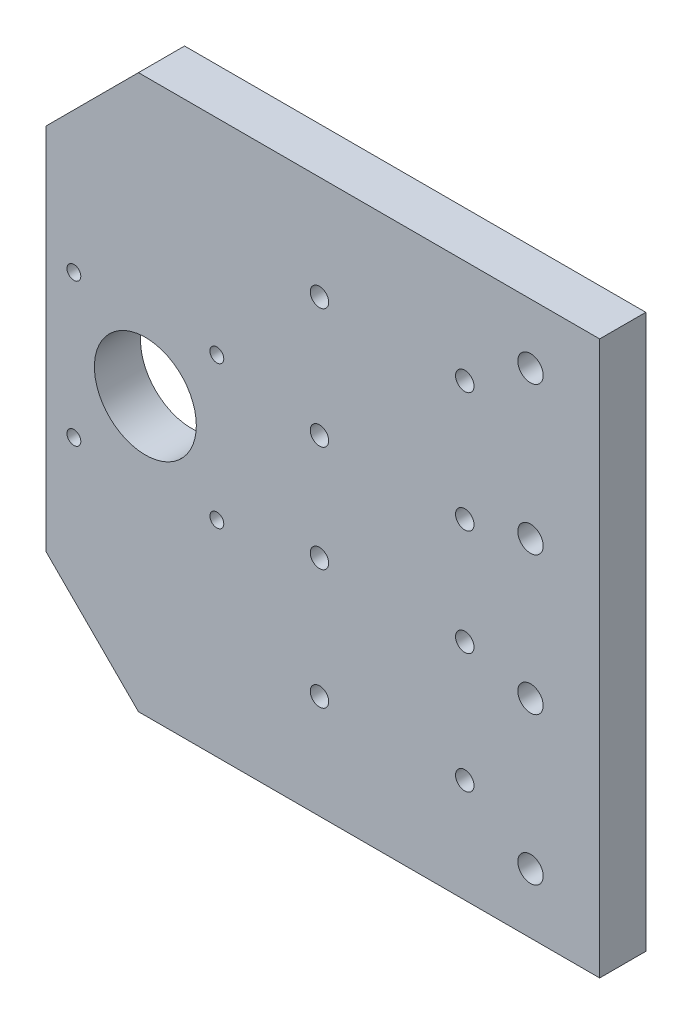
ISO-10303-21;
HEADER;
FILE_DESCRIPTION(('STEP AP214'),'2;1');
FILE_NAME('part.step','',(''),(''),'','','');
FILE_SCHEMA(('AUTOMOTIVE_DESIGN { 1 0 10303 214 1 1 1 1 }'));
ENDSEC;
DATA;
#1=APPLICATION_CONTEXT('core data for automotive mechanical design processes');
#2=APPLICATION_PROTOCOL_DEFINITION('international standard','automotive_design',2000,#1);
#3=PRODUCT_CONTEXT('',#1,'mechanical');
#4=PRODUCT('Part','Part','',(#3));
#5=PRODUCT_RELATED_PRODUCT_CATEGORY('part','',(#4));
#6=PRODUCT_DEFINITION_FORMATION('','',#4);
#7=PRODUCT_DEFINITION_CONTEXT('part definition',#1,'design');
#8=PRODUCT_DEFINITION('design','',#6,#7);
#9=PRODUCT_DEFINITION_SHAPE('','',#8);
#10=(LENGTH_UNIT() NAMED_UNIT(*) SI_UNIT(.MILLI.,.METRE.));
#11=(NAMED_UNIT(*) PLANE_ANGLE_UNIT() SI_UNIT($,.RADIAN.));
#12=(NAMED_UNIT(*) SI_UNIT($,.STERADIAN.) SOLID_ANGLE_UNIT());
#13=UNCERTAINTY_MEASURE_WITH_UNIT(LENGTH_MEASURE(1.E-05),#10,'distance_accuracy_value','');
#14=(GEOMETRIC_REPRESENTATION_CONTEXT(3) GLOBAL_UNCERTAINTY_ASSIGNED_CONTEXT((#13)) GLOBAL_UNIT_ASSIGNED_CONTEXT((#10,
#11,#12)) REPRESENTATION_CONTEXT('',''));
#15=CARTESIAN_POINT('',(0.,0.,0.));
#16=DIRECTION('',(0.,0.,1.));
#17=DIRECTION('',(1.,0.,0.));
#18=AXIS2_PLACEMENT_3D('',#15,#16,#17);
#19=CARTESIAN_POINT('',(0.,0.,10.));
#20=DIRECTION('',(0.,0.,1.));
#21=DIRECTION('',(1.,0.,0.));
#22=AXIS2_PLACEMENT_3D('',#19,#20,#21);
#23=PLANE('',#22);
#24=CARTESIAN_POINT('',(-15.,-15.,10.));
#25=DIRECTION('',(0.,0.,1.));
#26=DIRECTION('',(1.,0.,0.));
#27=AXIS2_PLACEMENT_3D('',#24,#25,#26);
#28=CIRCLE('',#27,2.75000000000001);
#29=CARTESIAN_POINT('',(-12.25,-15.,10.));
#30=VERTEX_POINT('',#29);
#31=EDGE_CURVE('E241',#30,#30,#28,.T.);
#32=ORIENTED_EDGE('',*,*,#31,.F.);
#33=EDGE_LOOP('',(#32));
#34=FACE_BOUND('',#33,.T.);
#35=CARTESIAN_POINT('',(-15.,47.,10.));
#36=DIRECTION('',(0.,0.,1.));
#37=DIRECTION('',(1.,0.,0.));
#38=AXIS2_PLACEMENT_3D('',#35,#36,#37);
#39=CIRCLE('',#38,2.75000000000001);
#40=CARTESIAN_POINT('',(-12.25,47.,10.));
#41=VERTEX_POINT('',#40);
#42=EDGE_CURVE('E253',#41,#41,#39,.T.);
#43=ORIENTED_EDGE('',*,*,#42,.F.);
#44=EDGE_LOOP('',(#43));
#45=FACE_BOUND('',#44,.T.);
#46=CARTESIAN_POINT('',(-29.25,-37.5,10.));
#47=DIRECTION('',(0.,0.,1.));
#48=DIRECTION('',(1.,0.,0.));
#49=AXIS2_PLACEMENT_3D('',#46,#47,#48);
#50=CIRCLE('',#49,2.);
#51=CARTESIAN_POINT('',(-27.25,-37.5,10.));
#52=VERTEX_POINT('',#51);
#53=EDGE_CURVE('E265',#52,#52,#50,.T.);
#54=ORIENTED_EDGE('',*,*,#53,.F.);
#55=EDGE_LOOP('',(#54));
#56=FACE_BOUND('',#55,.T.);
#57=CARTESIAN_POINT('',(-60.75,-11.5,10.));
#58=DIRECTION('',(0.,0.,1.));
#59=DIRECTION('',(1.,0.,0.));
#60=AXIS2_PLACEMENT_3D('',#57,#58,#59);
#61=CIRCLE('',#60,2.);
#62=CARTESIAN_POINT('',(-58.75,-11.5,10.));
#63=VERTEX_POINT('',#62);
#64=EDGE_CURVE('E277',#63,#63,#61,.T.);
#65=ORIENTED_EDGE('',*,*,#64,.F.);
#66=EDGE_LOOP('',(#65));
#67=FACE_BOUND('',#66,.T.);
#68=CARTESIAN_POINT('',(-60.75,11.5,10.));
#69=DIRECTION('',(0.,0.,1.));
#70=DIRECTION('',(1.,0.,0.));
#71=AXIS2_PLACEMENT_3D('',#68,#69,#70);
#72=CIRCLE('',#71,2.);
#73=CARTESIAN_POINT('',(-58.75,11.5,10.));
#74=VERTEX_POINT('',#73);
#75=EDGE_CURVE('E289',#74,#74,#72,.T.);
#76=ORIENTED_EDGE('',*,*,#75,.F.);
#77=EDGE_LOOP('',(#76));
#78=FACE_BOUND('',#77,.T.);
#79=CARTESIAN_POINT('',(-60.75,37.5,10.));
#80=DIRECTION('',(0.,0.,1.));
#81=DIRECTION('',(1.,0.,0.));
#82=AXIS2_PLACEMENT_3D('',#79,#80,#81);
#83=CIRCLE('',#82,2.);
#84=CARTESIAN_POINT('',(-58.75,37.5,10.));
#85=VERTEX_POINT('',#84);
#86=EDGE_CURVE('E301',#85,#85,#83,.T.);
#87=ORIENTED_EDGE('',*,*,#86,.F.);
#88=EDGE_LOOP('',(#87));
#89=FACE_BOUND('',#88,.T.);
#90=CARTESIAN_POINT('',(-114.,-15.5,10.));
#91=DIRECTION('',(0.,0.,1.));
#92=DIRECTION('',(1.,0.,0.));
#93=AXIS2_PLACEMENT_3D('',#90,#91,#92);
#94=CIRCLE('',#93,1.5);
#95=CARTESIAN_POINT('',(-112.5,-15.5,10.));
#96=VERTEX_POINT('',#95);
#97=EDGE_CURVE('E313',#96,#96,#94,.T.);
#98=ORIENTED_EDGE('',*,*,#97,.F.);
#99=EDGE_LOOP('',(#98));
#100=FACE_BOUND('',#99,.T.);
#101=CARTESIAN_POINT('',(-83.,15.5,10.));
#102=DIRECTION('',(0.,0.,1.));
#103=DIRECTION('',(1.,0.,0.));
#104=AXIS2_PLACEMENT_3D('',#101,#102,#103);
#105=CIRCLE('',#104,1.5);
#106=CARTESIAN_POINT('',(-81.5,15.5,10.));
#107=VERTEX_POINT('',#106);
#108=EDGE_CURVE('E325',#107,#107,#105,.T.);
#109=ORIENTED_EDGE('',*,*,#108,.F.);
#110=EDGE_LOOP('',(#109));
#111=FACE_BOUND('',#110,.T.);
#112=DIRECTION('',(-1.,0.,0.));
#113=VECTOR('',#112,1.);
#114=CARTESIAN_POINT('',(0.,60.,10.));
#115=LINE('',#114,#113);
#116=CARTESIAN_POINT('',(0.,60.,10.));
#117=VERTEX_POINT('',#116);
#118=CARTESIAN_POINT('',(-100.,60.,10.));
#119=VERTEX_POINT('',#118);
#120=EDGE_CURVE('E129',#117,#119,#115,.T.);
#121=ORIENTED_EDGE('',*,*,#120,.T.);
#122=DIRECTION('',(-0.707106781186548,-0.707106781186547,0.));
#123=VECTOR('',#122,1.);
#124=CARTESIAN_POINT('',(-100.,60.,10.));
#125=LINE('',#124,#123);
#126=CARTESIAN_POINT('',(-120.,40.,10.));
#127=VERTEX_POINT('',#126);
#128=EDGE_CURVE('E87',#119,#127,#125,.T.);
#129=ORIENTED_EDGE('',*,*,#128,.T.);
#130=DIRECTION('',(0.,-1.,0.));
#131=VECTOR('',#130,1.);
#132=CARTESIAN_POINT('',(-120.,40.,10.));
#133=LINE('',#132,#131);
#134=CARTESIAN_POINT('',(-120.,-40.,10.));
#135=VERTEX_POINT('',#134);
#136=EDGE_CURVE('E100',#127,#135,#133,.T.);
#137=ORIENTED_EDGE('',*,*,#136,.T.);
#138=DIRECTION('',(0.707106781186548,-0.707106781186547,0.));
#139=VECTOR('',#138,1.);
#140=CARTESIAN_POINT('',(-120.,-40.,10.));
#141=LINE('',#140,#139);
#142=CARTESIAN_POINT('',(-100.,-60.,10.));
#143=VERTEX_POINT('',#142);
#144=EDGE_CURVE('E94',#135,#143,#141,.T.);
#145=ORIENTED_EDGE('',*,*,#144,.T.);
#146=DIRECTION('',(1.,0.,0.));
#147=VECTOR('',#146,1.);
#148=CARTESIAN_POINT('',(-100.,-60.,10.));
#149=LINE('',#148,#147);
#150=CARTESIAN_POINT('',(0.,-60.,10.));
#151=VERTEX_POINT('',#150);
#152=EDGE_CURVE('E98',#143,#151,#149,.T.);
#153=ORIENTED_EDGE('',*,*,#152,.T.);
#154=DIRECTION('',(0.,1.,0.));
#155=VECTOR('',#154,1.);
#156=CARTESIAN_POINT('',(0.,-60.,10.));
#157=LINE('',#156,#155);
#158=EDGE_CURVE('E50',#151,#117,#157,.T.);
#159=ORIENTED_EDGE('',*,*,#158,.T.);
#160=EDGE_LOOP('',(#121,#129,#137,#145,#153,#159));
#161=FACE_BOUND('',#160,.T.);
#162=CARTESIAN_POINT('',(-98.5,0.,10.));
#163=DIRECTION('',(0.,0.,1.));
#164=DIRECTION('',(1.,0.,0.));
#165=AXIS2_PLACEMENT_3D('',#162,#163,#164);
#166=CIRCLE('',#165,11.05);
#167=CARTESIAN_POINT('',(-87.45,0.,10.));
#168=VERTEX_POINT('',#167);
#169=EDGE_CURVE('E122',#168,#168,#166,.T.);
#170=ORIENTED_EDGE('',*,*,#169,.F.);
#171=EDGE_LOOP('',(#170));
#172=FACE_BOUND('',#171,.T.);
#173=CARTESIAN_POINT('',(-114.,15.5,10.));
#174=DIRECTION('',(0.,0.,1.));
#175=DIRECTION('',(1.,0.,0.));
#176=AXIS2_PLACEMENT_3D('',#173,#174,#175);
#177=CIRCLE('',#176,1.5);
#178=CARTESIAN_POINT('',(-112.5,15.5,10.));
#179=VERTEX_POINT('',#178);
#180=EDGE_CURVE('E319',#179,#179,#177,.T.);
#181=ORIENTED_EDGE('',*,*,#180,.F.);
#182=EDGE_LOOP('',(#181));
#183=FACE_BOUND('',#182,.T.);
#184=CARTESIAN_POINT('',(-83.,-15.5,10.));
#185=DIRECTION('',(0.,0.,1.));
#186=DIRECTION('',(1.,0.,0.));
#187=AXIS2_PLACEMENT_3D('',#184,#185,#186);
#188=CIRCLE('',#187,1.5);
#189=CARTESIAN_POINT('',(-81.5,-15.5,10.));
#190=VERTEX_POINT('',#189);
#191=EDGE_CURVE('E307',#190,#190,#188,.T.);
#192=ORIENTED_EDGE('',*,*,#191,.F.);
#193=EDGE_LOOP('',(#192));
#194=FACE_BOUND('',#193,.T.);
#195=CARTESIAN_POINT('',(-29.25,37.5,10.));
#196=DIRECTION('',(0.,0.,1.));
#197=DIRECTION('',(1.,0.,0.));
#198=AXIS2_PLACEMENT_3D('',#195,#196,#197);
#199=CIRCLE('',#198,2.);
#200=CARTESIAN_POINT('',(-27.25,37.5,10.));
#201=VERTEX_POINT('',#200);
#202=EDGE_CURVE('E295',#201,#201,#199,.T.);
#203=ORIENTED_EDGE('',*,*,#202,.F.);
#204=EDGE_LOOP('',(#203));
#205=FACE_BOUND('',#204,.T.);
#206=CARTESIAN_POINT('',(-29.25,11.5,10.));
#207=DIRECTION('',(0.,0.,1.));
#208=DIRECTION('',(1.,0.,0.));
#209=AXIS2_PLACEMENT_3D('',#206,#207,#208);
#210=CIRCLE('',#209,2.);
#211=CARTESIAN_POINT('',(-27.25,11.5,10.));
#212=VERTEX_POINT('',#211);
#213=EDGE_CURVE('E283',#212,#212,#210,.T.);
#214=ORIENTED_EDGE('',*,*,#213,.F.);
#215=EDGE_LOOP('',(#214));
#216=FACE_BOUND('',#215,.T.);
#217=CARTESIAN_POINT('',(-29.25,-11.5,10.));
#218=DIRECTION('',(0.,0.,1.));
#219=DIRECTION('',(1.,0.,0.));
#220=AXIS2_PLACEMENT_3D('',#217,#218,#219);
#221=CIRCLE('',#220,2.);
#222=CARTESIAN_POINT('',(-27.25,-11.5,10.));
#223=VERTEX_POINT('',#222);
#224=EDGE_CURVE('E271',#223,#223,#221,.T.);
#225=ORIENTED_EDGE('',*,*,#224,.F.);
#226=EDGE_LOOP('',(#225));
#227=FACE_BOUND('',#226,.T.);
#228=CARTESIAN_POINT('',(-60.75,-37.5,10.));
#229=DIRECTION('',(0.,0.,1.));
#230=DIRECTION('',(1.,0.,0.));
#231=AXIS2_PLACEMENT_3D('',#228,#229,#230);
#232=CIRCLE('',#231,2.);
#233=CARTESIAN_POINT('',(-58.75,-37.5,10.));
#234=VERTEX_POINT('',#233);
#235=EDGE_CURVE('E259',#234,#234,#232,.T.);
#236=ORIENTED_EDGE('',*,*,#235,.F.);
#237=EDGE_LOOP('',(#236));
#238=FACE_BOUND('',#237,.T.);
#239=CARTESIAN_POINT('',(-15.,15.,10.));
#240=DIRECTION('',(0.,0.,1.));
#241=DIRECTION('',(1.,0.,0.));
#242=AXIS2_PLACEMENT_3D('',#239,#240,#241);
#243=CIRCLE('',#242,2.75000000000001);
#244=CARTESIAN_POINT('',(-12.25,15.,10.));
#245=VERTEX_POINT('',#244);
#246=EDGE_CURVE('E247',#245,#245,#243,.T.);
#247=ORIENTED_EDGE('',*,*,#246,.F.);
#248=EDGE_LOOP('',(#247));
#249=FACE_BOUND('',#248,.T.);
#250=CARTESIAN_POINT('',(-15.,-47.,10.));
#251=DIRECTION('',(0.,0.,1.));
#252=DIRECTION('',(1.,0.,0.));
#253=AXIS2_PLACEMENT_3D('',#250,#251,#252);
#254=CIRCLE('',#253,2.75000000000001);
#255=CARTESIAN_POINT('',(-12.25,-47.,10.));
#256=VERTEX_POINT('',#255);
#257=EDGE_CURVE('E232',#256,#256,#254,.T.);
#258=ORIENTED_EDGE('',*,*,#257,.F.);
#259=EDGE_LOOP('',(#258));
#260=FACE_BOUND('',#259,.T.);
#261=ADVANCED_FACE('F33',(#34,#45,#56,#67,#78,#89,#100,#111,#161,#172,#183,#194,#205,#216,#227,
#238,#249,#260),#23,.T.);
#262=CARTESIAN_POINT('',(0.,0.,0.));
#263=DIRECTION('',(0.,0.,1.));
#264=DIRECTION('',(1.,0.,0.));
#265=AXIS2_PLACEMENT_3D('',#262,#263,#264);
#266=PLANE('',#265);
#267=DIRECTION('',(-1.,0.,0.));
#268=VECTOR('',#267,1.);
#269=CARTESIAN_POINT('',(0.,60.,0.));
#270=LINE('',#269,#268);
#271=CARTESIAN_POINT('',(0.,60.,0.));
#272=VERTEX_POINT('',#271);
#273=CARTESIAN_POINT('',(-100.,60.,0.));
#274=VERTEX_POINT('',#273);
#275=EDGE_CURVE('E118',#272,#274,#270,.T.);
#276=ORIENTED_EDGE('',*,*,#275,.F.);
#277=DIRECTION('',(0.,1.,0.));
#278=VECTOR('',#277,1.);
#279=CARTESIAN_POINT('',(0.,-60.,0.));
#280=LINE('',#279,#278);
#281=CARTESIAN_POINT('',(0.,-60.,0.));
#282=VERTEX_POINT('',#281);
#283=EDGE_CURVE('E79',#282,#272,#280,.T.);
#284=ORIENTED_EDGE('',*,*,#283,.F.);
#285=DIRECTION('',(1.,0.,0.));
#286=VECTOR('',#285,1.);
#287=CARTESIAN_POINT('',(-100.,-60.,0.));
#288=LINE('',#287,#286);
#289=CARTESIAN_POINT('',(-100.,-60.,0.));
#290=VERTEX_POINT('',#289);
#291=EDGE_CURVE('E73',#290,#282,#288,.T.);
#292=ORIENTED_EDGE('',*,*,#291,.F.);
#293=DIRECTION('',(0.707106781186548,-0.707106781186547,0.));
#294=VECTOR('',#293,1.);
#295=CARTESIAN_POINT('',(-120.,-40.,0.));
#296=LINE('',#295,#294);
#297=CARTESIAN_POINT('',(-120.,-40.,0.));
#298=VERTEX_POINT('',#297);
#299=EDGE_CURVE('E108',#298,#290,#296,.T.);
#300=ORIENTED_EDGE('',*,*,#299,.F.);
#301=DIRECTION('',(0.,-1.,0.));
#302=VECTOR('',#301,1.);
#303=CARTESIAN_POINT('',(-120.,40.,0.));
#304=LINE('',#303,#302);
#305=CARTESIAN_POINT('',(-120.,40.,0.));
#306=VERTEX_POINT('',#305);
#307=EDGE_CURVE('E124',#306,#298,#304,.T.);
#308=ORIENTED_EDGE('',*,*,#307,.F.);
#309=DIRECTION('',(-0.707106781186548,-0.707106781186547,0.));
#310=VECTOR('',#309,1.);
#311=CARTESIAN_POINT('',(-100.,60.,0.));
#312=LINE('',#311,#310);
#313=EDGE_CURVE('E121',#274,#306,#312,.T.);
#314=ORIENTED_EDGE('',*,*,#313,.F.);
#315=EDGE_LOOP('',(#276,#284,#292,#300,#308,#314));
#316=FACE_BOUND('',#315,.T.);
#317=CARTESIAN_POINT('',(-98.5,0.,0.));
#318=DIRECTION('',(0.,0.,1.));
#319=DIRECTION('',(1.,0.,0.));
#320=AXIS2_PLACEMENT_3D('',#317,#318,#319);
#321=CIRCLE('',#320,11.05);
#322=CARTESIAN_POINT('',(-87.45,0.,0.));
#323=VERTEX_POINT('',#322);
#324=EDGE_CURVE('E328',#323,#323,#321,.T.);
#325=ORIENTED_EDGE('',*,*,#324,.T.);
#326=EDGE_LOOP('',(#325));
#327=FACE_BOUND('',#326,.T.);
#328=CARTESIAN_POINT('',(-83.,15.5,0.));
#329=DIRECTION('',(0.,0.,1.));
#330=DIRECTION('',(1.,0.,0.));
#331=AXIS2_PLACEMENT_3D('',#328,#329,#330);
#332=CIRCLE('',#331,1.5);
#333=CARTESIAN_POINT('',(-81.5,15.5,0.));
#334=VERTEX_POINT('',#333);
#335=EDGE_CURVE('E322',#334,#334,#332,.T.);
#336=ORIENTED_EDGE('',*,*,#335,.T.);
#337=EDGE_LOOP('',(#336));
#338=FACE_BOUND('',#337,.T.);
#339=CARTESIAN_POINT('',(-114.,15.5,0.));
#340=DIRECTION('',(0.,0.,1.));
#341=DIRECTION('',(1.,0.,0.));
#342=AXIS2_PLACEMENT_3D('',#339,#340,#341);
#343=CIRCLE('',#342,1.5);
#344=CARTESIAN_POINT('',(-112.5,15.5,0.));
#345=VERTEX_POINT('',#344);
#346=EDGE_CURVE('E316',#345,#345,#343,.T.);
#347=ORIENTED_EDGE('',*,*,#346,.T.);
#348=EDGE_LOOP('',(#347));
#349=FACE_BOUND('',#348,.T.);
#350=CARTESIAN_POINT('',(-114.,-15.5,0.));
#351=DIRECTION('',(0.,0.,1.));
#352=DIRECTION('',(1.,0.,0.));
#353=AXIS2_PLACEMENT_3D('',#350,#351,#352);
#354=CIRCLE('',#353,1.5);
#355=CARTESIAN_POINT('',(-112.5,-15.5,0.));
#356=VERTEX_POINT('',#355);
#357=EDGE_CURVE('E310',#356,#356,#354,.T.);
#358=ORIENTED_EDGE('',*,*,#357,.T.);
#359=EDGE_LOOP('',(#358));
#360=FACE_BOUND('',#359,.T.);
#361=CARTESIAN_POINT('',(-83.,-15.5,0.));
#362=DIRECTION('',(0.,0.,1.));
#363=DIRECTION('',(1.,0.,0.));
#364=AXIS2_PLACEMENT_3D('',#361,#362,#363);
#365=CIRCLE('',#364,1.5);
#366=CARTESIAN_POINT('',(-81.5,-15.5,0.));
#367=VERTEX_POINT('',#366);
#368=EDGE_CURVE('E304',#367,#367,#365,.T.);
#369=ORIENTED_EDGE('',*,*,#368,.T.);
#370=EDGE_LOOP('',(#369));
#371=FACE_BOUND('',#370,.T.);
#372=CARTESIAN_POINT('',(-60.75,37.5,0.));
#373=DIRECTION('',(0.,0.,1.));
#374=DIRECTION('',(1.,0.,0.));
#375=AXIS2_PLACEMENT_3D('',#372,#373,#374);
#376=CIRCLE('',#375,2.);
#377=CARTESIAN_POINT('',(-58.75,37.5,0.));
#378=VERTEX_POINT('',#377);
#379=EDGE_CURVE('E298',#378,#378,#376,.T.);
#380=ORIENTED_EDGE('',*,*,#379,.T.);
#381=EDGE_LOOP('',(#380));
#382=FACE_BOUND('',#381,.T.);
#383=CARTESIAN_POINT('',(-29.25,37.5,0.));
#384=DIRECTION('',(0.,0.,1.));
#385=DIRECTION('',(1.,0.,0.));
#386=AXIS2_PLACEMENT_3D('',#383,#384,#385);
#387=CIRCLE('',#386,2.);
#388=CARTESIAN_POINT('',(-27.25,37.5,0.));
#389=VERTEX_POINT('',#388);
#390=EDGE_CURVE('E292',#389,#389,#387,.T.);
#391=ORIENTED_EDGE('',*,*,#390,.T.);
#392=EDGE_LOOP('',(#391));
#393=FACE_BOUND('',#392,.T.);
#394=CARTESIAN_POINT('',(-60.75,11.5,0.));
#395=DIRECTION('',(0.,0.,1.));
#396=DIRECTION('',(1.,0.,0.));
#397=AXIS2_PLACEMENT_3D('',#394,#395,#396);
#398=CIRCLE('',#397,2.);
#399=CARTESIAN_POINT('',(-58.75,11.5,0.));
#400=VERTEX_POINT('',#399);
#401=EDGE_CURVE('E286',#400,#400,#398,.T.);
#402=ORIENTED_EDGE('',*,*,#401,.T.);
#403=EDGE_LOOP('',(#402));
#404=FACE_BOUND('',#403,.T.);
#405=CARTESIAN_POINT('',(-29.25,11.5,0.));
#406=DIRECTION('',(0.,0.,1.));
#407=DIRECTION('',(1.,0.,0.));
#408=AXIS2_PLACEMENT_3D('',#405,#406,#407);
#409=CIRCLE('',#408,2.);
#410=CARTESIAN_POINT('',(-27.25,11.5,0.));
#411=VERTEX_POINT('',#410);
#412=EDGE_CURVE('E280',#411,#411,#409,.T.);
#413=ORIENTED_EDGE('',*,*,#412,.T.);
#414=EDGE_LOOP('',(#413));
#415=FACE_BOUND('',#414,.T.);
#416=CARTESIAN_POINT('',(-60.75,-11.5,0.));
#417=DIRECTION('',(0.,0.,1.));
#418=DIRECTION('',(1.,0.,0.));
#419=AXIS2_PLACEMENT_3D('',#416,#417,#418);
#420=CIRCLE('',#419,2.);
#421=CARTESIAN_POINT('',(-58.75,-11.5,0.));
#422=VERTEX_POINT('',#421);
#423=EDGE_CURVE('E274',#422,#422,#420,.T.);
#424=ORIENTED_EDGE('',*,*,#423,.T.);
#425=EDGE_LOOP('',(#424));
#426=FACE_BOUND('',#425,.T.);
#427=CARTESIAN_POINT('',(-29.25,-11.5,0.));
#428=DIRECTION('',(0.,0.,1.));
#429=DIRECTION('',(1.,0.,0.));
#430=AXIS2_PLACEMENT_3D('',#427,#428,#429);
#431=CIRCLE('',#430,2.);
#432=CARTESIAN_POINT('',(-27.25,-11.5,0.));
#433=VERTEX_POINT('',#432);
#434=EDGE_CURVE('E268',#433,#433,#431,.T.);
#435=ORIENTED_EDGE('',*,*,#434,.T.);
#436=EDGE_LOOP('',(#435));
#437=FACE_BOUND('',#436,.T.);
#438=CARTESIAN_POINT('',(-29.25,-37.5,0.));
#439=DIRECTION('',(0.,0.,1.));
#440=DIRECTION('',(1.,0.,0.));
#441=AXIS2_PLACEMENT_3D('',#438,#439,#440);
#442=CIRCLE('',#441,2.);
#443=CARTESIAN_POINT('',(-27.25,-37.5,0.));
#444=VERTEX_POINT('',#443);
#445=EDGE_CURVE('E262',#444,#444,#442,.T.);
#446=ORIENTED_EDGE('',*,*,#445,.T.);
#447=EDGE_LOOP('',(#446));
#448=FACE_BOUND('',#447,.T.);
#449=CARTESIAN_POINT('',(-60.75,-37.5,0.));
#450=DIRECTION('',(0.,0.,1.));
#451=DIRECTION('',(1.,0.,0.));
#452=AXIS2_PLACEMENT_3D('',#449,#450,#451);
#453=CIRCLE('',#452,2.);
#454=CARTESIAN_POINT('',(-58.75,-37.5,0.));
#455=VERTEX_POINT('',#454);
#456=EDGE_CURVE('E256',#455,#455,#453,.T.);
#457=ORIENTED_EDGE('',*,*,#456,.T.);
#458=EDGE_LOOP('',(#457));
#459=FACE_BOUND('',#458,.T.);
#460=CARTESIAN_POINT('',(-15.,47.,0.));
#461=DIRECTION('',(0.,0.,1.));
#462=DIRECTION('',(1.,0.,0.));
#463=AXIS2_PLACEMENT_3D('',#460,#461,#462);
#464=CIRCLE('',#463,2.75000000000001);
#465=CARTESIAN_POINT('',(-12.25,47.,0.));
#466=VERTEX_POINT('',#465);
#467=EDGE_CURVE('E250',#466,#466,#464,.T.);
#468=ORIENTED_EDGE('',*,*,#467,.T.);
#469=EDGE_LOOP('',(#468));
#470=FACE_BOUND('',#469,.T.);
#471=CARTESIAN_POINT('',(-15.,15.,0.));
#472=DIRECTION('',(0.,0.,1.));
#473=DIRECTION('',(1.,0.,0.));
#474=AXIS2_PLACEMENT_3D('',#471,#472,#473);
#475=CIRCLE('',#474,2.75000000000001);
#476=CARTESIAN_POINT('',(-12.25,15.,0.));
#477=VERTEX_POINT('',#476);
#478=EDGE_CURVE('E244',#477,#477,#475,.T.);
#479=ORIENTED_EDGE('',*,*,#478,.T.);
#480=EDGE_LOOP('',(#479));
#481=FACE_BOUND('',#480,.T.);
#482=CARTESIAN_POINT('',(-15.,-15.,0.));
#483=DIRECTION('',(0.,0.,1.));
#484=DIRECTION('',(1.,0.,0.));
#485=AXIS2_PLACEMENT_3D('',#482,#483,#484);
#486=CIRCLE('',#485,2.75000000000001);
#487=CARTESIAN_POINT('',(-12.25,-15.,0.));
#488=VERTEX_POINT('',#487);
#489=EDGE_CURVE('E238',#488,#488,#486,.T.);
#490=ORIENTED_EDGE('',*,*,#489,.T.);
#491=EDGE_LOOP('',(#490));
#492=FACE_BOUND('',#491,.T.);
#493=CARTESIAN_POINT('',(-15.,-47.,0.));
#494=DIRECTION('',(0.,0.,1.));
#495=DIRECTION('',(1.,0.,0.));
#496=AXIS2_PLACEMENT_3D('',#493,#494,#495);
#497=CIRCLE('',#496,2.75000000000001);
#498=CARTESIAN_POINT('',(-12.25,-47.,0.));
#499=VERTEX_POINT('',#498);
#500=EDGE_CURVE('E235',#499,#499,#497,.T.);
#501=ORIENTED_EDGE('',*,*,#500,.T.);
#502=EDGE_LOOP('',(#501));
#503=FACE_BOUND('',#502,.T.);
#504=ADVANCED_FACE('F138',(#316,#327,#338,#349,#360,#371,#382,#393,#404,#415,#426,#437,#448,
#459,#470,#481,#492,#503),#266,.F.);
#505=CARTESIAN_POINT('',(0.,60.,10.));
#506=DIRECTION('',(0.,-1.,0.));
#507=DIRECTION('',(1.,0.,0.));
#508=AXIS2_PLACEMENT_3D('',#505,#506,#507);
#509=PLANE('',#508);
#510=ORIENTED_EDGE('',*,*,#275,.T.);
#511=DIRECTION('',(0.,0.,-1.));
#512=VECTOR('',#511,1.);
#513=CARTESIAN_POINT('',(-100.,60.,10.));
#514=LINE('',#513,#512);
#515=EDGE_CURVE('E11',#119,#274,#514,.T.);
#516=ORIENTED_EDGE('',*,*,#515,.F.);
#517=ORIENTED_EDGE('',*,*,#120,.F.);
#518=DIRECTION('',(0.,0.,-1.));
#519=VECTOR('',#518,1.);
#520=CARTESIAN_POINT('',(0.,60.,10.));
#521=LINE('',#520,#519);
#522=EDGE_CURVE('E114',#117,#272,#521,.T.);
#523=ORIENTED_EDGE('',*,*,#522,.T.);
#524=EDGE_LOOP('',(#510,#516,#517,#523));
#525=FACE_BOUND('',#524,.T.);
#526=ADVANCED_FACE('F35',(#525),#509,.F.);
#527=CARTESIAN_POINT('',(-100.,60.,10.));
#528=DIRECTION('',(0.707106781186547,-0.707106781186548,0.));
#529=DIRECTION('',(0.707106781186548,0.707106781186547,0.));
#530=AXIS2_PLACEMENT_3D('',#527,#528,#529);
#531=PLANE('',#530);
#532=ORIENTED_EDGE('',*,*,#313,.T.);
#533=DIRECTION('',(0.,0.,-1.));
#534=VECTOR('',#533,1.);
#535=CARTESIAN_POINT('',(-120.,40.,10.));
#536=LINE('',#535,#534);
#537=EDGE_CURVE('E42',#127,#306,#536,.T.);
#538=ORIENTED_EDGE('',*,*,#537,.F.);
#539=ORIENTED_EDGE('',*,*,#128,.F.);
#540=ORIENTED_EDGE('',*,*,#515,.T.);
#541=EDGE_LOOP('',(#532,#538,#539,#540));
#542=FACE_BOUND('',#541,.T.);
#543=ADVANCED_FACE('F503',(#542),#531,.F.);
#544=CARTESIAN_POINT('',(-120.,40.,10.));
#545=DIRECTION('',(1.,0.,0.));
#546=DIRECTION('',(0.,1.,0.));
#547=AXIS2_PLACEMENT_3D('',#544,#545,#546);
#548=PLANE('',#547);
#549=ORIENTED_EDGE('',*,*,#307,.T.);
#550=DIRECTION('',(0.,0.,-1.));
#551=VECTOR('',#550,1.);
#552=CARTESIAN_POINT('',(-120.,-40.,10.));
#553=LINE('',#552,#551);
#554=EDGE_CURVE('E109',#135,#298,#553,.T.);
#555=ORIENTED_EDGE('',*,*,#554,.F.);
#556=ORIENTED_EDGE('',*,*,#136,.F.);
#557=ORIENTED_EDGE('',*,*,#537,.T.);
#558=EDGE_LOOP('',(#549,#555,#556,#557));
#559=FACE_BOUND('',#558,.T.);
#560=ADVANCED_FACE('F135',(#559),#548,.F.);
#561=CARTESIAN_POINT('',(-120.,-40.,10.));
#562=DIRECTION('',(0.707106781186547,0.707106781186548,0.));
#563=DIRECTION('',(-0.707106781186548,0.707106781186547,0.));
#564=AXIS2_PLACEMENT_3D('',#561,#562,#563);
#565=PLANE('',#564);
#566=ORIENTED_EDGE('',*,*,#299,.T.);
#567=DIRECTION('',(0.,0.,-1.));
#568=VECTOR('',#567,1.);
#569=CARTESIAN_POINT('',(-100.,-60.,10.));
#570=LINE('',#569,#568);
#571=EDGE_CURVE('E105',#143,#290,#570,.T.);
#572=ORIENTED_EDGE('',*,*,#571,.F.);
#573=ORIENTED_EDGE('',*,*,#144,.F.);
#574=ORIENTED_EDGE('',*,*,#554,.T.);
#575=EDGE_LOOP('',(#566,#572,#573,#574));
#576=FACE_BOUND('',#575,.T.);
#577=ADVANCED_FACE('F106',(#576),#565,.F.);
#578=CARTESIAN_POINT('',(-100.,-60.,10.));
#579=DIRECTION('',(0.,1.,0.));
#580=DIRECTION('',(0.,0.,1.));
#581=AXIS2_PLACEMENT_3D('',#578,#579,#580);
#582=PLANE('',#581);
#583=ORIENTED_EDGE('',*,*,#291,.T.);
#584=DIRECTION('',(0.,0.,-1.));
#585=VECTOR('',#584,1.);
#586=CARTESIAN_POINT('',(0.,-60.,10.));
#587=LINE('',#586,#585);
#588=EDGE_CURVE('E110',#151,#282,#587,.T.);
#589=ORIENTED_EDGE('',*,*,#588,.F.);
#590=ORIENTED_EDGE('',*,*,#152,.F.);
#591=ORIENTED_EDGE('',*,*,#571,.T.);
#592=EDGE_LOOP('',(#583,#589,#590,#591));
#593=FACE_BOUND('',#592,.T.);
#594=ADVANCED_FACE('F112',(#593),#582,.F.);
#595=CARTESIAN_POINT('',(0.,-60.,10.));
#596=DIRECTION('',(-1.,0.,0.));
#597=DIRECTION('',(0.,0.,1.));
#598=AXIS2_PLACEMENT_3D('',#595,#596,#597);
#599=PLANE('',#598);
#600=ORIENTED_EDGE('',*,*,#283,.T.);
#601=ORIENTED_EDGE('',*,*,#522,.F.);
#602=ORIENTED_EDGE('',*,*,#158,.F.);
#603=ORIENTED_EDGE('',*,*,#588,.T.);
#604=EDGE_LOOP('',(#600,#601,#602,#603));
#605=FACE_BOUND('',#604,.T.);
#606=ADVANCED_FACE('F143',(#605),#599,.F.);
#607=CARTESIAN_POINT('',(-98.5,0.,10.));
#608=DIRECTION('',(0.,0.,-1.));
#609=DIRECTION('',(-1.,0.,0.));
#610=AXIS2_PLACEMENT_3D('',#607,#608,#609);
#611=CYLINDRICAL_SURFACE('',#610,11.05);
#612=ORIENTED_EDGE('',*,*,#169,.T.);
#613=EDGE_LOOP('',(#612));
#614=FACE_BOUND('',#613,.T.);
#615=ORIENTED_EDGE('',*,*,#324,.F.);
#616=EDGE_LOOP('',(#615));
#617=FACE_BOUND('',#616,.T.);
#618=ADVANCED_FACE('F145',(#614,#617),#611,.F.);
#619=CARTESIAN_POINT('',(-83.,15.5,10.));
#620=DIRECTION('',(0.,0.,-1.));
#621=DIRECTION('',(-1.,0.,0.));
#622=AXIS2_PLACEMENT_3D('',#619,#620,#621);
#623=CYLINDRICAL_SURFACE('',#622,1.5);
#624=ORIENTED_EDGE('',*,*,#108,.T.);
#625=EDGE_LOOP('',(#624));
#626=FACE_BOUND('',#625,.T.);
#627=ORIENTED_EDGE('',*,*,#335,.F.);
#628=EDGE_LOOP('',(#627));
#629=FACE_BOUND('',#628,.T.);
#630=ADVANCED_FACE('F151',(#626,#629),#623,.F.);
#631=CARTESIAN_POINT('',(-114.,15.5,10.));
#632=DIRECTION('',(0.,0.,-1.));
#633=DIRECTION('',(-1.,0.,0.));
#634=AXIS2_PLACEMENT_3D('',#631,#632,#633);
#635=CYLINDRICAL_SURFACE('',#634,1.5);
#636=ORIENTED_EDGE('',*,*,#180,.T.);
#637=EDGE_LOOP('',(#636));
#638=FACE_BOUND('',#637,.T.);
#639=ORIENTED_EDGE('',*,*,#346,.F.);
#640=EDGE_LOOP('',(#639));
#641=FACE_BOUND('',#640,.T.);
#642=ADVANCED_FACE('F167',(#638,#641),#635,.F.);
#643=CARTESIAN_POINT('',(-114.,-15.5,10.));
#644=DIRECTION('',(0.,0.,-1.));
#645=DIRECTION('',(-1.,0.,0.));
#646=AXIS2_PLACEMENT_3D('',#643,#644,#645);
#647=CYLINDRICAL_SURFACE('',#646,1.5);
#648=ORIENTED_EDGE('',*,*,#97,.T.);
#649=EDGE_LOOP('',(#648));
#650=FACE_BOUND('',#649,.T.);
#651=ORIENTED_EDGE('',*,*,#357,.F.);
#652=EDGE_LOOP('',(#651));
#653=FACE_BOUND('',#652,.T.);
#654=ADVANCED_FACE('F171',(#650,#653),#647,.F.);
#655=CARTESIAN_POINT('',(-83.,-15.5,10.));
#656=DIRECTION('',(0.,0.,-1.));
#657=DIRECTION('',(-1.,0.,0.));
#658=AXIS2_PLACEMENT_3D('',#655,#656,#657);
#659=CYLINDRICAL_SURFACE('',#658,1.5);
#660=ORIENTED_EDGE('',*,*,#191,.T.);
#661=EDGE_LOOP('',(#660));
#662=FACE_BOUND('',#661,.T.);
#663=ORIENTED_EDGE('',*,*,#368,.F.);
#664=EDGE_LOOP('',(#663));
#665=FACE_BOUND('',#664,.T.);
#666=ADVANCED_FACE('F175',(#662,#665),#659,.F.);
#667=CARTESIAN_POINT('',(-60.75,37.5,10.));
#668=DIRECTION('',(0.,0.,-1.));
#669=DIRECTION('',(-1.,0.,0.));
#670=AXIS2_PLACEMENT_3D('',#667,#668,#669);
#671=CYLINDRICAL_SURFACE('',#670,2.);
#672=ORIENTED_EDGE('',*,*,#86,.T.);
#673=EDGE_LOOP('',(#672));
#674=FACE_BOUND('',#673,.T.);
#675=ORIENTED_EDGE('',*,*,#379,.F.);
#676=EDGE_LOOP('',(#675));
#677=FACE_BOUND('',#676,.T.);
#678=ADVANCED_FACE('F179',(#674,#677),#671,.F.);
#679=CARTESIAN_POINT('',(-29.25,37.5,10.));
#680=DIRECTION('',(0.,0.,-1.));
#681=DIRECTION('',(-1.,0.,0.));
#682=AXIS2_PLACEMENT_3D('',#679,#680,#681);
#683=CYLINDRICAL_SURFACE('',#682,2.);
#684=ORIENTED_EDGE('',*,*,#202,.T.);
#685=EDGE_LOOP('',(#684));
#686=FACE_BOUND('',#685,.T.);
#687=ORIENTED_EDGE('',*,*,#390,.F.);
#688=EDGE_LOOP('',(#687));
#689=FACE_BOUND('',#688,.T.);
#690=ADVANCED_FACE('F183',(#686,#689),#683,.F.);
#691=CARTESIAN_POINT('',(-60.75,11.5,10.));
#692=DIRECTION('',(0.,0.,-1.));
#693=DIRECTION('',(-1.,0.,0.));
#694=AXIS2_PLACEMENT_3D('',#691,#692,#693);
#695=CYLINDRICAL_SURFACE('',#694,2.);
#696=ORIENTED_EDGE('',*,*,#75,.T.);
#697=EDGE_LOOP('',(#696));
#698=FACE_BOUND('',#697,.T.);
#699=ORIENTED_EDGE('',*,*,#401,.F.);
#700=EDGE_LOOP('',(#699));
#701=FACE_BOUND('',#700,.T.);
#702=ADVANCED_FACE('F187',(#698,#701),#695,.F.);
#703=CARTESIAN_POINT('',(-29.25,11.5,10.));
#704=DIRECTION('',(0.,0.,-1.));
#705=DIRECTION('',(-1.,0.,0.));
#706=AXIS2_PLACEMENT_3D('',#703,#704,#705);
#707=CYLINDRICAL_SURFACE('',#706,2.);
#708=ORIENTED_EDGE('',*,*,#213,.T.);
#709=EDGE_LOOP('',(#708));
#710=FACE_BOUND('',#709,.T.);
#711=ORIENTED_EDGE('',*,*,#412,.F.);
#712=EDGE_LOOP('',(#711));
#713=FACE_BOUND('',#712,.T.);
#714=ADVANCED_FACE('F191',(#710,#713),#707,.F.);
#715=CARTESIAN_POINT('',(-60.75,-11.5,10.));
#716=DIRECTION('',(0.,0.,-1.));
#717=DIRECTION('',(-1.,0.,0.));
#718=AXIS2_PLACEMENT_3D('',#715,#716,#717);
#719=CYLINDRICAL_SURFACE('',#718,2.);
#720=ORIENTED_EDGE('',*,*,#64,.T.);
#721=EDGE_LOOP('',(#720));
#722=FACE_BOUND('',#721,.T.);
#723=ORIENTED_EDGE('',*,*,#423,.F.);
#724=EDGE_LOOP('',(#723));
#725=FACE_BOUND('',#724,.T.);
#726=ADVANCED_FACE('F195',(#722,#725),#719,.F.);
#727=CARTESIAN_POINT('',(-29.25,-11.5,10.));
#728=DIRECTION('',(0.,0.,-1.));
#729=DIRECTION('',(-1.,0.,0.));
#730=AXIS2_PLACEMENT_3D('',#727,#728,#729);
#731=CYLINDRICAL_SURFACE('',#730,2.);
#732=ORIENTED_EDGE('',*,*,#224,.T.);
#733=EDGE_LOOP('',(#732));
#734=FACE_BOUND('',#733,.T.);
#735=ORIENTED_EDGE('',*,*,#434,.F.);
#736=EDGE_LOOP('',(#735));
#737=FACE_BOUND('',#736,.T.);
#738=ADVANCED_FACE('F199',(#734,#737),#731,.F.);
#739=CARTESIAN_POINT('',(-29.25,-37.5,10.));
#740=DIRECTION('',(0.,0.,-1.));
#741=DIRECTION('',(-1.,0.,0.));
#742=AXIS2_PLACEMENT_3D('',#739,#740,#741);
#743=CYLINDRICAL_SURFACE('',#742,2.);
#744=ORIENTED_EDGE('',*,*,#53,.T.);
#745=EDGE_LOOP('',(#744));
#746=FACE_BOUND('',#745,.T.);
#747=ORIENTED_EDGE('',*,*,#445,.F.);
#748=EDGE_LOOP('',(#747));
#749=FACE_BOUND('',#748,.T.);
#750=ADVANCED_FACE('F203',(#746,#749),#743,.F.);
#751=CARTESIAN_POINT('',(-60.75,-37.5,10.));
#752=DIRECTION('',(0.,0.,-1.));
#753=DIRECTION('',(-1.,0.,0.));
#754=AXIS2_PLACEMENT_3D('',#751,#752,#753);
#755=CYLINDRICAL_SURFACE('',#754,2.);
#756=ORIENTED_EDGE('',*,*,#235,.T.);
#757=EDGE_LOOP('',(#756));
#758=FACE_BOUND('',#757,.T.);
#759=ORIENTED_EDGE('',*,*,#456,.F.);
#760=EDGE_LOOP('',(#759));
#761=FACE_BOUND('',#760,.T.);
#762=ADVANCED_FACE('F207',(#758,#761),#755,.F.);
#763=CARTESIAN_POINT('',(-15.,47.,10.));
#764=DIRECTION('',(0.,0.,-1.));
#765=DIRECTION('',(-1.,0.,0.));
#766=AXIS2_PLACEMENT_3D('',#763,#764,#765);
#767=CYLINDRICAL_SURFACE('',#766,2.75000000000001);
#768=ORIENTED_EDGE('',*,*,#42,.T.);
#769=EDGE_LOOP('',(#768));
#770=FACE_BOUND('',#769,.T.);
#771=ORIENTED_EDGE('',*,*,#467,.F.);
#772=EDGE_LOOP('',(#771));
#773=FACE_BOUND('',#772,.T.);
#774=ADVANCED_FACE('F211',(#770,#773),#767,.F.);
#775=CARTESIAN_POINT('',(-15.,15.,10.));
#776=DIRECTION('',(0.,0.,-1.));
#777=DIRECTION('',(-1.,0.,0.));
#778=AXIS2_PLACEMENT_3D('',#775,#776,#777);
#779=CYLINDRICAL_SURFACE('',#778,2.75000000000001);
#780=ORIENTED_EDGE('',*,*,#246,.T.);
#781=EDGE_LOOP('',(#780));
#782=FACE_BOUND('',#781,.T.);
#783=ORIENTED_EDGE('',*,*,#478,.F.);
#784=EDGE_LOOP('',(#783));
#785=FACE_BOUND('',#784,.T.);
#786=ADVANCED_FACE('F215',(#782,#785),#779,.F.);
#787=CARTESIAN_POINT('',(-15.,-15.,10.));
#788=DIRECTION('',(0.,0.,-1.));
#789=DIRECTION('',(-1.,0.,0.));
#790=AXIS2_PLACEMENT_3D('',#787,#788,#789);
#791=CYLINDRICAL_SURFACE('',#790,2.75000000000001);
#792=ORIENTED_EDGE('',*,*,#31,.T.);
#793=EDGE_LOOP('',(#792));
#794=FACE_BOUND('',#793,.T.);
#795=ORIENTED_EDGE('',*,*,#489,.F.);
#796=EDGE_LOOP('',(#795));
#797=FACE_BOUND('',#796,.T.);
#798=ADVANCED_FACE('F219',(#794,#797),#791,.F.);
#799=CARTESIAN_POINT('',(-15.,-47.,10.));
#800=DIRECTION('',(0.,0.,-1.));
#801=DIRECTION('',(-1.,0.,0.));
#802=AXIS2_PLACEMENT_3D('',#799,#800,#801);
#803=CYLINDRICAL_SURFACE('',#802,2.75000000000001);
#804=ORIENTED_EDGE('',*,*,#257,.T.);
#805=EDGE_LOOP('',(#804));
#806=FACE_BOUND('',#805,.T.);
#807=ORIENTED_EDGE('',*,*,#500,.F.);
#808=EDGE_LOOP('',(#807));
#809=FACE_BOUND('',#808,.T.);
#810=ADVANCED_FACE('F223',(#806,#809),#803,.F.);
#811=CLOSED_SHELL('',(#261,#504,#526,#543,#560,#577,#594,#606,#618,#630,#642,#654,#666,#678,
#690,#702,#714,#726,#738,#750,#762,#774,#786,#798,#810));
#812=MANIFOLD_SOLID_BREP('B2',#811);
#813=ADVANCED_BREP_SHAPE_REPRESENTATION('',(#18,#812),#14);
#814=SHAPE_DEFINITION_REPRESENTATION(#9,#813);
ENDSEC;
END-ISO-10303-21;
